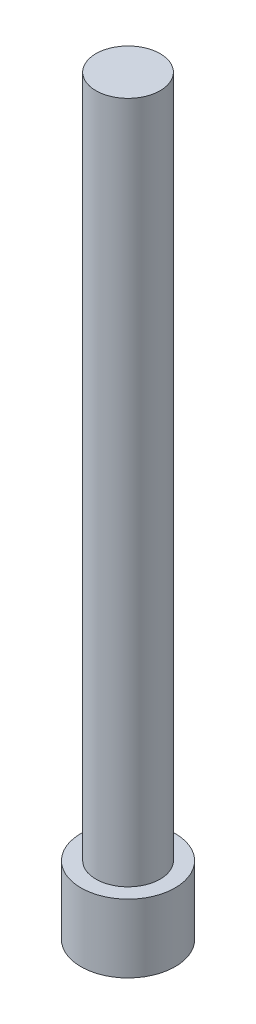
ISO-10303-21;
HEADER;
FILE_DESCRIPTION(('STEP AP214'),'2;1');
FILE_NAME('part.step','',(''),(''),'','','');
FILE_SCHEMA(('AUTOMOTIVE_DESIGN { 1 0 10303 214 1 1 1 1 }'));
ENDSEC;
DATA;
#1=APPLICATION_CONTEXT('core data for automotive mechanical design processes');
#2=APPLICATION_PROTOCOL_DEFINITION('international standard','automotive_design',2000,#1);
#3=PRODUCT_CONTEXT('',#1,'mechanical');
#4=PRODUCT('Part','Part','',(#3));
#5=PRODUCT_RELATED_PRODUCT_CATEGORY('part','',(#4));
#6=PRODUCT_DEFINITION_FORMATION('','',#4);
#7=PRODUCT_DEFINITION_CONTEXT('part definition',#1,'design');
#8=PRODUCT_DEFINITION('design','',#6,#7);
#9=PRODUCT_DEFINITION_SHAPE('','',#8);
#10=(LENGTH_UNIT() NAMED_UNIT(*) SI_UNIT(.MILLI.,.METRE.));
#11=(NAMED_UNIT(*) PLANE_ANGLE_UNIT() SI_UNIT($,.RADIAN.));
#12=(NAMED_UNIT(*) SI_UNIT($,.STERADIAN.) SOLID_ANGLE_UNIT());
#13=UNCERTAINTY_MEASURE_WITH_UNIT(LENGTH_MEASURE(1.E-05),#10,'distance_accuracy_value','');
#14=(GEOMETRIC_REPRESENTATION_CONTEXT(3) GLOBAL_UNCERTAINTY_ASSIGNED_CONTEXT((#13)) GLOBAL_UNIT_ASSIGNED_CONTEXT((#10,
#11,#12)) REPRESENTATION_CONTEXT('',''));
#15=CARTESIAN_POINT('',(0.,0.,0.));
#16=DIRECTION('',(0.,0.,1.));
#17=DIRECTION('',(1.,0.,0.));
#18=AXIS2_PLACEMENT_3D('',#15,#16,#17);
#19=CARTESIAN_POINT('',(0.,55.,0.));
#20=DIRECTION('',(0.,-1.,0.));
#21=DIRECTION('',(0.,0.,-1.));
#22=AXIS2_PLACEMENT_3D('',#19,#20,#21);
#23=CYLINDRICAL_SURFACE('',#22,2.35);
#24=CARTESIAN_POINT('',(0.,55.,0.));
#25=DIRECTION('',(0.,1.,0.));
#26=DIRECTION('',(0.,0.,1.));
#27=AXIS2_PLACEMENT_3D('',#24,#25,#26);
#28=CIRCLE('',#27,2.35);
#29=CARTESIAN_POINT('',(0.,55.,2.35));
#30=VERTEX_POINT('',#29);
#31=EDGE_CURVE('E44',#30,#30,#28,.T.);
#32=ORIENTED_EDGE('',*,*,#31,.F.);
#33=EDGE_LOOP('',(#32));
#34=FACE_BOUND('',#33,.T.);
#35=CARTESIAN_POINT('',(0.,5.,0.));
#36=DIRECTION('',(0.,-1.,0.));
#37=DIRECTION('',(0.,0.,-1.));
#38=AXIS2_PLACEMENT_3D('',#35,#36,#37);
#39=CIRCLE('',#38,2.35);
#40=CARTESIAN_POINT('',(0.,5.,-2.35));
#41=VERTEX_POINT('',#40);
#42=EDGE_CURVE('E10',#41,#41,#39,.T.);
#43=ORIENTED_EDGE('',*,*,#42,.F.);
#44=EDGE_LOOP('',(#43));
#45=FACE_BOUND('',#44,.T.);
#46=ADVANCED_FACE('F37',(#34,#45),#23,.T.);
#47=CARTESIAN_POINT('',(0.,55.,0.));
#48=DIRECTION('',(0.,1.,0.));
#49=DIRECTION('',(0.,0.,1.));
#50=AXIS2_PLACEMENT_3D('',#47,#48,#49);
#51=PLANE('',#50);
#52=ORIENTED_EDGE('',*,*,#31,.T.);
#53=EDGE_LOOP('',(#52));
#54=FACE_BOUND('',#53,.T.);
#55=ADVANCED_FACE('F66',(#54),#51,.T.);
#56=CARTESIAN_POINT('',(0.,5.,0.));
#57=DIRECTION('',(0.,-1.,0.));
#58=DIRECTION('',(0.,0.,-1.));
#59=AXIS2_PLACEMENT_3D('',#56,#57,#58);
#60=CYLINDRICAL_SURFACE('',#59,3.45);
#61=CARTESIAN_POINT('',(0.,5.,0.));
#62=DIRECTION('',(0.,-1.,0.));
#63=DIRECTION('',(0.,0.,-1.));
#64=AXIS2_PLACEMENT_3D('',#61,#62,#63);
#65=CIRCLE('',#64,3.45);
#66=CARTESIAN_POINT('',(0.,5.,-3.45));
#67=VERTEX_POINT('',#66);
#68=EDGE_CURVE('E49',#67,#67,#65,.T.);
#69=ORIENTED_EDGE('',*,*,#68,.T.);
#70=EDGE_LOOP('',(#69));
#71=FACE_BOUND('',#70,.T.);
#72=CARTESIAN_POINT('',(0.,0.,0.));
#73=DIRECTION('',(0.,-1.,0.));
#74=DIRECTION('',(0.,0.,-1.));
#75=AXIS2_PLACEMENT_3D('',#72,#73,#74);
#76=CIRCLE('',#75,3.45);
#77=CARTESIAN_POINT('',(0.,0.,-3.45));
#78=VERTEX_POINT('',#77);
#79=EDGE_CURVE('E54',#78,#78,#76,.T.);
#80=ORIENTED_EDGE('',*,*,#79,.F.);
#81=EDGE_LOOP('',(#80));
#82=FACE_BOUND('',#81,.T.);
#83=ADVANCED_FACE('F63',(#71,#82),#60,.T.);
#84=CARTESIAN_POINT('',(0.,5.,0.));
#85=DIRECTION('',(0.,-1.,0.));
#86=DIRECTION('',(0.,0.,-1.));
#87=AXIS2_PLACEMENT_3D('',#84,#85,#86);
#88=PLANE('',#87);
#89=ORIENTED_EDGE('',*,*,#42,.T.);
#90=EDGE_LOOP('',(#89));
#91=FACE_BOUND('',#90,.T.);
#92=ORIENTED_EDGE('',*,*,#68,.F.);
#93=EDGE_LOOP('',(#92));
#94=FACE_BOUND('',#93,.T.);
#95=ADVANCED_FACE('F65',(#91,#94),#88,.F.);
#96=CARTESIAN_POINT('',(0.,0.,0.));
#97=DIRECTION('',(0.,1.,0.));
#98=DIRECTION('',(0.,0.,1.));
#99=AXIS2_PLACEMENT_3D('',#96,#97,#98);
#100=PLANE('',#99);
#101=ORIENTED_EDGE('',*,*,#79,.T.);
#102=EDGE_LOOP('',(#101));
#103=FACE_BOUND('',#102,.T.);
#104=ADVANCED_FACE('F61',(#103),#100,.F.);
#105=CLOSED_SHELL('',(#46,#55,#83,#95,#104));
#106=MANIFOLD_SOLID_BREP('B2',#105);
#107=ADVANCED_BREP_SHAPE_REPRESENTATION('',(#18,#106),#14);
#108=SHAPE_DEFINITION_REPRESENTATION(#9,#107);
ENDSEC;
END-ISO-10303-21;
